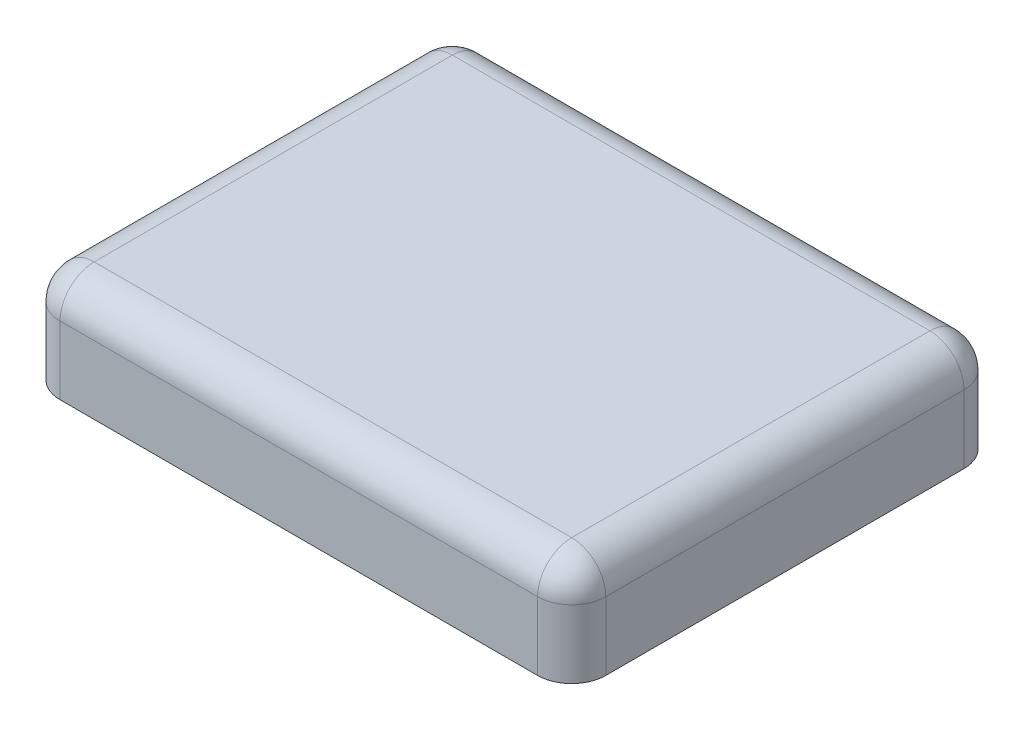
ISO-10303-21;
HEADER;
FILE_DESCRIPTION(('STEP AP214'),'2;1');
FILE_NAME('part.step','',(''),(''),'','','');
FILE_SCHEMA(('AUTOMOTIVE_DESIGN { 1 0 10303 214 1 1 1 1 }'));
ENDSEC;
DATA;
#1=APPLICATION_CONTEXT('core data for automotive mechanical design processes');
#2=APPLICATION_PROTOCOL_DEFINITION('international standard','automotive_design',2000,#1);
#3=PRODUCT_CONTEXT('',#1,'mechanical');
#4=PRODUCT('Part','Part','',(#3));
#5=PRODUCT_RELATED_PRODUCT_CATEGORY('part','',(#4));
#6=PRODUCT_DEFINITION_FORMATION('','',#4);
#7=PRODUCT_DEFINITION_CONTEXT('part definition',#1,'design');
#8=PRODUCT_DEFINITION('design','',#6,#7);
#9=PRODUCT_DEFINITION_SHAPE('','',#8);
#10=(LENGTH_UNIT() NAMED_UNIT(*) SI_UNIT(.MILLI.,.METRE.));
#11=(NAMED_UNIT(*) PLANE_ANGLE_UNIT() SI_UNIT($,.RADIAN.));
#12=(NAMED_UNIT(*) SI_UNIT($,.STERADIAN.) SOLID_ANGLE_UNIT());
#13=UNCERTAINTY_MEASURE_WITH_UNIT(LENGTH_MEASURE(1.E-05),#10,'distance_accuracy_value','');
#14=(GEOMETRIC_REPRESENTATION_CONTEXT(3) GLOBAL_UNCERTAINTY_ASSIGNED_CONTEXT((#13)) GLOBAL_UNIT_ASSIGNED_CONTEXT((#10,
#11,#12)) REPRESENTATION_CONTEXT('',''));
#15=CARTESIAN_POINT('',(0.,0.,0.));
#16=DIRECTION('',(0.,0.,1.));
#17=DIRECTION('',(1.,0.,0.));
#18=AXIS2_PLACEMENT_3D('',#15,#16,#17);
#19=CARTESIAN_POINT('',(1.6,0.6,-1.25));
#20=DIRECTION('',(-1.,0.,0.));
#21=DIRECTION('',(0.,0.,1.));
#22=AXIS2_PLACEMENT_3D('',#19,#20,#21);
#23=PLANE('',#22);
#24=DIRECTION('',(0.,-1.,0.));
#25=VECTOR('',#24,1.);
#26=CARTESIAN_POINT('',(1.6,0.6,-1.05));
#27=LINE('',#26,#25);
#28=CARTESIAN_POINT('',(1.6,0.,-1.05));
#29=VERTEX_POINT('',#28);
#30=CARTESIAN_POINT('',(1.6,0.4,-1.05));
#31=VERTEX_POINT('',#30);
#32=EDGE_CURVE('E129',#29,#31,#27,.F.);
#33=ORIENTED_EDGE('',*,*,#32,.T.);
#34=DIRECTION('',(0.,0.,-1.));
#35=VECTOR('',#34,1.);
#36=CARTESIAN_POINT('',(1.6,0.4,1.05));
#37=LINE('',#36,#35);
#38=CARTESIAN_POINT('',(1.6,0.4,1.05));
#39=VERTEX_POINT('',#38);
#40=EDGE_CURVE('E69',#31,#39,#37,.F.);
#41=ORIENTED_EDGE('',*,*,#40,.T.);
#42=DIRECTION('',(0.,-1.,0.));
#43=VECTOR('',#42,1.);
#44=CARTESIAN_POINT('',(1.6,0.6,1.05));
#45=LINE('',#44,#43);
#46=CARTESIAN_POINT('',(1.6,0.,1.05));
#47=VERTEX_POINT('',#46);
#48=EDGE_CURVE('E122',#39,#47,#45,.T.);
#49=ORIENTED_EDGE('',*,*,#48,.T.);
#50=DIRECTION('',(0.,0.,-1.));
#51=VECTOR('',#50,1.);
#52=CARTESIAN_POINT('',(1.6,0.,-1.25));
#53=LINE('',#52,#51);
#54=EDGE_CURVE('E125',#47,#29,#53,.T.);
#55=ORIENTED_EDGE('',*,*,#54,.T.);
#56=EDGE_LOOP('',(#33,#41,#49,#55));
#57=FACE_BOUND('',#56,.T.);
#58=ADVANCED_FACE('F45',(#57),#23,.F.);
#59=CARTESIAN_POINT('',(-1.6,0.6,-1.25));
#60=DIRECTION('',(0.,0.,1.));
#61=DIRECTION('',(1.,0.,0.));
#62=AXIS2_PLACEMENT_3D('',#59,#60,#61);
#63=PLANE('',#62);
#64=DIRECTION('',(0.,-1.,0.));
#65=VECTOR('',#64,1.);
#66=CARTESIAN_POINT('',(-1.4,0.6,-1.25));
#67=LINE('',#66,#65);
#68=CARTESIAN_POINT('',(-1.4,0.,-1.25));
#69=VERTEX_POINT('',#68);
#70=CARTESIAN_POINT('',(-1.4,0.4,-1.25));
#71=VERTEX_POINT('',#70);
#72=EDGE_CURVE('E162',#69,#71,#67,.F.);
#73=ORIENTED_EDGE('',*,*,#72,.T.);
#74=DIRECTION('',(-1.,0.,0.));
#75=VECTOR('',#74,1.);
#76=CARTESIAN_POINT('',(1.4,0.4,-1.25));
#77=LINE('',#76,#75);
#78=CARTESIAN_POINT('',(1.4,0.4,-1.25));
#79=VERTEX_POINT('',#78);
#80=EDGE_CURVE('E188',#71,#79,#77,.F.);
#81=ORIENTED_EDGE('',*,*,#80,.T.);
#82=DIRECTION('',(0.,-1.,0.));
#83=VECTOR('',#82,1.);
#84=CARTESIAN_POINT('',(1.4,0.6,-1.25));
#85=LINE('',#84,#83);
#86=CARTESIAN_POINT('',(1.4,0.,-1.25));
#87=VERTEX_POINT('',#86);
#88=EDGE_CURVE('E165',#79,#87,#85,.T.);
#89=ORIENTED_EDGE('',*,*,#88,.T.);
#90=DIRECTION('',(-1.,0.,0.));
#91=VECTOR('',#90,1.);
#92=CARTESIAN_POINT('',(-1.6,0.,-1.25));
#93=LINE('',#92,#91);
#94=EDGE_CURVE('E143',#87,#69,#93,.T.);
#95=ORIENTED_EDGE('',*,*,#94,.T.);
#96=EDGE_LOOP('',(#73,#81,#89,#95));
#97=FACE_BOUND('',#96,.T.);
#98=ADVANCED_FACE('F247',(#97),#63,.F.);
#99=CARTESIAN_POINT('',(-1.6,0.6,-1.25));
#100=DIRECTION('',(1.,0.,0.));
#101=DIRECTION('',(0.,0.,-1.));
#102=AXIS2_PLACEMENT_3D('',#99,#100,#101);
#103=PLANE('',#102);
#104=DIRECTION('',(0.,-1.,0.));
#105=VECTOR('',#104,1.);
#106=CARTESIAN_POINT('',(-1.6,0.6,1.05));
#107=LINE('',#106,#105);
#108=CARTESIAN_POINT('',(-1.6,0.,1.05));
#109=VERTEX_POINT('',#108);
#110=CARTESIAN_POINT('',(-1.6,0.4,1.05));
#111=VERTEX_POINT('',#110);
#112=EDGE_CURVE('E169',#109,#111,#107,.F.);
#113=ORIENTED_EDGE('',*,*,#112,.T.);
#114=DIRECTION('',(0.,0.,1.));
#115=VECTOR('',#114,1.);
#116=CARTESIAN_POINT('',(-1.6,0.4,-1.05));
#117=LINE('',#116,#115);
#118=CARTESIAN_POINT('',(-1.6,0.4,-1.05));
#119=VERTEX_POINT('',#118);
#120=EDGE_CURVE('E184',#111,#119,#117,.F.);
#121=ORIENTED_EDGE('',*,*,#120,.T.);
#122=DIRECTION('',(0.,-1.,0.));
#123=VECTOR('',#122,1.);
#124=CARTESIAN_POINT('',(-1.6,0.6,-1.05));
#125=LINE('',#124,#123);
#126=CARTESIAN_POINT('',(-1.6,0.,-1.05));
#127=VERTEX_POINT('',#126);
#128=EDGE_CURVE('E167',#119,#127,#125,.T.);
#129=ORIENTED_EDGE('',*,*,#128,.T.);
#130=DIRECTION('',(0.,0.,1.));
#131=VECTOR('',#130,1.);
#132=CARTESIAN_POINT('',(-1.6,0.,-1.25));
#133=LINE('',#132,#131);
#134=EDGE_CURVE('E146',#127,#109,#133,.T.);
#135=ORIENTED_EDGE('',*,*,#134,.T.);
#136=EDGE_LOOP('',(#113,#121,#129,#135));
#137=FACE_BOUND('',#136,.T.);
#138=ADVANCED_FACE('F253',(#137),#103,.F.);
#139=CARTESIAN_POINT('',(-1.6,0.6,1.25));
#140=DIRECTION('',(0.,0.,-1.));
#141=DIRECTION('',(-1.,0.,0.));
#142=AXIS2_PLACEMENT_3D('',#139,#140,#141);
#143=PLANE('',#142);
#144=DIRECTION('',(0.,-1.,0.));
#145=VECTOR('',#144,1.);
#146=CARTESIAN_POINT('',(1.4,0.6,1.25));
#147=LINE('',#146,#145);
#148=CARTESIAN_POINT('',(1.4,0.,1.25));
#149=VERTEX_POINT('',#148);
#150=CARTESIAN_POINT('',(1.4,0.4,1.25));
#151=VERTEX_POINT('',#150);
#152=EDGE_CURVE('E133',#149,#151,#147,.F.);
#153=ORIENTED_EDGE('',*,*,#152,.T.);
#154=DIRECTION('',(1.,0.,0.));
#155=VECTOR('',#154,1.);
#156=CARTESIAN_POINT('',(-1.4,0.4,1.25));
#157=LINE('',#156,#155);
#158=CARTESIAN_POINT('',(-1.4,0.4,1.25));
#159=VERTEX_POINT('',#158);
#160=EDGE_CURVE('E11',#151,#159,#157,.F.);
#161=ORIENTED_EDGE('',*,*,#160,.T.);
#162=DIRECTION('',(0.,-1.,0.));
#163=VECTOR('',#162,1.);
#164=CARTESIAN_POINT('',(-1.4,0.6,1.25));
#165=LINE('',#164,#163);
#166=CARTESIAN_POINT('',(-1.4,0.,1.25));
#167=VERTEX_POINT('',#166);
#168=EDGE_CURVE('E137',#159,#167,#165,.T.);
#169=ORIENTED_EDGE('',*,*,#168,.T.);
#170=DIRECTION('',(1.,0.,0.));
#171=VECTOR('',#170,1.);
#172=CARTESIAN_POINT('',(-1.6,0.,1.25));
#173=LINE('',#172,#171);
#174=EDGE_CURVE('E153',#167,#149,#173,.T.);
#175=ORIENTED_EDGE('',*,*,#174,.T.);
#176=EDGE_LOOP('',(#153,#161,#169,#175));
#177=FACE_BOUND('',#176,.T.);
#178=ADVANCED_FACE('F346',(#177),#143,.F.);
#179=CARTESIAN_POINT('',(0.,0.6,0.));
#180=DIRECTION('',(0.,1.,0.));
#181=DIRECTION('',(0.,0.,1.));
#182=AXIS2_PLACEMENT_3D('',#179,#180,#181);
#183=PLANE('',#182);
#184=DIRECTION('',(-1.,0.,0.));
#185=VECTOR('',#184,1.);
#186=CARTESIAN_POINT('',(-1.4,0.6,-1.05));
#187=LINE('',#186,#185);
#188=CARTESIAN_POINT('',(1.4,0.6,-1.05));
#189=VERTEX_POINT('',#188);
#190=CARTESIAN_POINT('',(-1.4,0.6,-1.05));
#191=VERTEX_POINT('',#190);
#192=EDGE_CURVE('E179',#189,#191,#187,.T.);
#193=ORIENTED_EDGE('',*,*,#192,.T.);
#194=DIRECTION('',(0.,0.,1.));
#195=VECTOR('',#194,1.);
#196=CARTESIAN_POINT('',(-1.4,0.6,1.05));
#197=LINE('',#196,#195);
#198=CARTESIAN_POINT('',(-1.4,0.6,1.05));
#199=VERTEX_POINT('',#198);
#200=EDGE_CURVE('E181',#191,#199,#197,.T.);
#201=ORIENTED_EDGE('',*,*,#200,.T.);
#202=DIRECTION('',(1.,0.,0.));
#203=VECTOR('',#202,1.);
#204=CARTESIAN_POINT('',(1.4,0.6,1.05));
#205=LINE('',#204,#203);
#206=CARTESIAN_POINT('',(1.4,0.6,1.05));
#207=VERTEX_POINT('',#206);
#208=EDGE_CURVE('E175',#199,#207,#205,.T.);
#209=ORIENTED_EDGE('',*,*,#208,.T.);
#210=DIRECTION('',(0.,0.,-1.));
#211=VECTOR('',#210,1.);
#212=CARTESIAN_POINT('',(1.4,0.6,-1.05));
#213=LINE('',#212,#211);
#214=EDGE_CURVE('E177',#207,#189,#213,.T.);
#215=ORIENTED_EDGE('',*,*,#214,.T.);
#216=EDGE_LOOP('',(#193,#201,#209,#215));
#217=FACE_BOUND('',#216,.T.);
#218=ADVANCED_FACE('F224',(#217),#183,.T.);
#219=CARTESIAN_POINT('',(0.,0.,0.));
#220=DIRECTION('',(0.,1.,0.));
#221=DIRECTION('',(0.,0.,1.));
#222=AXIS2_PLACEMENT_3D('',#219,#220,#221);
#223=PLANE('',#222);
#224=ORIENTED_EDGE('',*,*,#54,.F.);
#225=CARTESIAN_POINT('',(1.4,0.,1.05));
#226=DIRECTION('',(0.,1.,0.));
#227=DIRECTION('',(0.,0.,1.));
#228=AXIS2_PLACEMENT_3D('',#225,#226,#227);
#229=CIRCLE('',#228,0.2);
#230=EDGE_CURVE('E131',#47,#149,#229,.F.);
#231=ORIENTED_EDGE('',*,*,#230,.T.);
#232=ORIENTED_EDGE('',*,*,#174,.F.);
#233=CARTESIAN_POINT('',(-1.4,0.,1.05));
#234=DIRECTION('',(0.,1.,0.));
#235=DIRECTION('',(0.,0.,1.));
#236=AXIS2_PLACEMENT_3D('',#233,#234,#235);
#237=CIRCLE('',#236,0.2);
#238=EDGE_CURVE('E157',#167,#109,#237,.F.);
#239=ORIENTED_EDGE('',*,*,#238,.T.);
#240=ORIENTED_EDGE('',*,*,#134,.F.);
#241=CARTESIAN_POINT('',(-1.4,0.,-1.05));
#242=DIRECTION('',(0.,1.,0.));
#243=DIRECTION('',(0.,0.,1.));
#244=AXIS2_PLACEMENT_3D('',#241,#242,#243);
#245=CIRCLE('',#244,0.2);
#246=EDGE_CURVE('E128',#127,#69,#245,.F.);
#247=ORIENTED_EDGE('',*,*,#246,.T.);
#248=ORIENTED_EDGE('',*,*,#94,.F.);
#249=CARTESIAN_POINT('',(1.4,0.,-1.05));
#250=DIRECTION('',(0.,1.,0.));
#251=DIRECTION('',(0.,0.,1.));
#252=AXIS2_PLACEMENT_3D('',#249,#250,#251);
#253=CIRCLE('',#252,0.2);
#254=EDGE_CURVE('E138',#87,#29,#253,.F.);
#255=ORIENTED_EDGE('',*,*,#254,.T.);
#256=EDGE_LOOP('',(#224,#231,#232,#239,#240,#247,#248,#255));
#257=FACE_BOUND('',#256,.T.);
#258=ADVANCED_FACE('F140',(#257),#223,.F.);
#259=CARTESIAN_POINT('',(1.4,0.6,1.05));
#260=DIRECTION('',(0.,-1.,0.));
#261=DIRECTION('',(0.,0.,-1.));
#262=AXIS2_PLACEMENT_3D('',#259,#260,#261);
#263=CYLINDRICAL_SURFACE('',#262,0.2);
#264=ORIENTED_EDGE('',*,*,#48,.F.);
#265=CARTESIAN_POINT('',(1.4,0.4,1.05));
#266=DIRECTION('',(0.,-1.,0.));
#267=DIRECTION('',(0.,0.,-1.));
#268=AXIS2_PLACEMENT_3D('',#265,#266,#267);
#269=CIRCLE('',#268,0.2);
#270=EDGE_CURVE('E54',#39,#151,#269,.T.);
#271=ORIENTED_EDGE('',*,*,#270,.T.);
#272=ORIENTED_EDGE('',*,*,#152,.F.);
#273=ORIENTED_EDGE('',*,*,#230,.F.);
#274=EDGE_LOOP('',(#264,#271,#272,#273));
#275=FACE_BOUND('',#274,.T.);
#276=ADVANCED_FACE('F132',(#275),#263,.T.);
#277=CARTESIAN_POINT('',(1.4,0.6,-1.05));
#278=DIRECTION('',(0.,-1.,0.));
#279=DIRECTION('',(0.,0.,-1.));
#280=AXIS2_PLACEMENT_3D('',#277,#278,#279);
#281=CYLINDRICAL_SURFACE('',#280,0.2);
#282=ORIENTED_EDGE('',*,*,#88,.F.);
#283=CARTESIAN_POINT('',(1.4,0.4,-1.05));
#284=DIRECTION('',(0.,-1.,0.));
#285=DIRECTION('',(0.,0.,-1.));
#286=AXIS2_PLACEMENT_3D('',#283,#284,#285);
#287=CIRCLE('',#286,0.2);
#288=EDGE_CURVE('E190',#79,#31,#287,.T.);
#289=ORIENTED_EDGE('',*,*,#288,.T.);
#290=ORIENTED_EDGE('',*,*,#32,.F.);
#291=ORIENTED_EDGE('',*,*,#254,.F.);
#292=EDGE_LOOP('',(#282,#289,#290,#291));
#293=FACE_BOUND('',#292,.T.);
#294=ADVANCED_FACE('F260',(#293),#281,.T.);
#295=CARTESIAN_POINT('',(-1.4,0.6,1.05));
#296=DIRECTION('',(0.,-1.,0.));
#297=DIRECTION('',(0.,0.,-1.));
#298=AXIS2_PLACEMENT_3D('',#295,#296,#297);
#299=CYLINDRICAL_SURFACE('',#298,0.2);
#300=ORIENTED_EDGE('',*,*,#168,.F.);
#301=CARTESIAN_POINT('',(-1.4,0.4,1.05));
#302=DIRECTION('',(0.,-1.,0.));
#303=DIRECTION('',(0.,0.,-1.));
#304=AXIS2_PLACEMENT_3D('',#301,#302,#303);
#305=CIRCLE('',#304,0.2);
#306=EDGE_CURVE('E172',#159,#111,#305,.T.);
#307=ORIENTED_EDGE('',*,*,#306,.T.);
#308=ORIENTED_EDGE('',*,*,#112,.F.);
#309=ORIENTED_EDGE('',*,*,#238,.F.);
#310=EDGE_LOOP('',(#300,#307,#308,#309));
#311=FACE_BOUND('',#310,.T.);
#312=ADVANCED_FACE('F263',(#311),#299,.T.);
#313=CARTESIAN_POINT('',(-1.4,0.6,-1.05));
#314=DIRECTION('',(0.,-1.,0.));
#315=DIRECTION('',(0.,0.,-1.));
#316=AXIS2_PLACEMENT_3D('',#313,#314,#315);
#317=CYLINDRICAL_SURFACE('',#316,0.2);
#318=ORIENTED_EDGE('',*,*,#128,.F.);
#319=CARTESIAN_POINT('',(-1.4,0.4,-1.05));
#320=DIRECTION('',(0.,-1.,0.));
#321=DIRECTION('',(0.,0.,-1.));
#322=AXIS2_PLACEMENT_3D('',#319,#320,#321);
#323=CIRCLE('',#322,0.2);
#324=EDGE_CURVE('E186',#119,#71,#323,.T.);
#325=ORIENTED_EDGE('',*,*,#324,.T.);
#326=ORIENTED_EDGE('',*,*,#72,.F.);
#327=ORIENTED_EDGE('',*,*,#246,.F.);
#328=EDGE_LOOP('',(#318,#325,#326,#327));
#329=FACE_BOUND('',#328,.T.);
#330=ADVANCED_FACE('F267',(#329),#317,.T.);
#331=CARTESIAN_POINT('',(1.4,0.4,-1.05));
#332=DIRECTION('',(0.,1.,0.));
#333=DIRECTION('',(0.,0.,1.));
#334=AXIS2_PLACEMENT_3D('',#331,#332,#333);
#335=SPHERICAL_SURFACE('',#334,0.2);
#336=CARTESIAN_POINT('',(1.4,0.4,-1.05));
#337=DIRECTION('',(0.,0.,1.));
#338=DIRECTION('',(1.,0.,0.));
#339=AXIS2_PLACEMENT_3D('',#336,#337,#338);
#340=CIRCLE('',#339,0.2);
#341=EDGE_CURVE('E149',#31,#189,#340,.T.);
#342=ORIENTED_EDGE('',*,*,#341,.F.);
#343=ORIENTED_EDGE('',*,*,#288,.F.);
#344=CARTESIAN_POINT('',(1.4,0.4,-1.05));
#345=DIRECTION('',(-1.,0.,0.));
#346=DIRECTION('',(0.,0.,1.));
#347=AXIS2_PLACEMENT_3D('',#344,#345,#346);
#348=CIRCLE('',#347,0.2);
#349=EDGE_CURVE('E49',#189,#79,#348,.T.);
#350=ORIENTED_EDGE('',*,*,#349,.F.);
#351=EDGE_LOOP('',(#342,#343,#350));
#352=FACE_BOUND('',#351,.T.);
#353=ADVANCED_FACE('F47',(#352),#335,.T.);
#354=CARTESIAN_POINT('',(0.,0.4,-1.05));
#355=DIRECTION('',(1.,0.,0.));
#356=DIRECTION('',(0.,0.,-1.));
#357=AXIS2_PLACEMENT_3D('',#354,#355,#356);
#358=CYLINDRICAL_SURFACE('',#357,0.2);
#359=ORIENTED_EDGE('',*,*,#349,.T.);
#360=ORIENTED_EDGE('',*,*,#80,.F.);
#361=CARTESIAN_POINT('',(-1.4,0.4,-1.05));
#362=DIRECTION('',(-1.,0.,0.));
#363=DIRECTION('',(0.,0.,1.));
#364=AXIS2_PLACEMENT_3D('',#361,#362,#363);
#365=CIRCLE('',#364,0.2);
#366=EDGE_CURVE('E207',#191,#71,#365,.T.);
#367=ORIENTED_EDGE('',*,*,#366,.F.);
#368=ORIENTED_EDGE('',*,*,#192,.F.);
#369=EDGE_LOOP('',(#359,#360,#367,#368));
#370=FACE_BOUND('',#369,.T.);
#371=ADVANCED_FACE('F221',(#370),#358,.T.);
#372=CARTESIAN_POINT('',(1.4,0.4,0.));
#373=DIRECTION('',(0.,0.,1.));
#374=DIRECTION('',(1.,0.,0.));
#375=AXIS2_PLACEMENT_3D('',#372,#373,#374);
#376=CYLINDRICAL_SURFACE('',#375,0.2);
#377=ORIENTED_EDGE('',*,*,#341,.T.);
#378=ORIENTED_EDGE('',*,*,#214,.F.);
#379=CARTESIAN_POINT('',(1.4,0.4,1.05));
#380=DIRECTION('',(0.,0.,1.));
#381=DIRECTION('',(1.,0.,0.));
#382=AXIS2_PLACEMENT_3D('',#379,#380,#381);
#383=CIRCLE('',#382,0.2);
#384=EDGE_CURVE('E204',#39,#207,#383,.T.);
#385=ORIENTED_EDGE('',*,*,#384,.F.);
#386=ORIENTED_EDGE('',*,*,#40,.F.);
#387=EDGE_LOOP('',(#377,#378,#385,#386));
#388=FACE_BOUND('',#387,.T.);
#389=ADVANCED_FACE('F214',(#388),#376,.T.);
#390=CARTESIAN_POINT('',(-1.4,0.4,-1.05));
#391=DIRECTION('',(0.,1.,0.));
#392=DIRECTION('',(0.,0.,1.));
#393=AXIS2_PLACEMENT_3D('',#390,#391,#392);
#394=SPHERICAL_SURFACE('',#393,0.2);
#395=ORIENTED_EDGE('',*,*,#366,.T.);
#396=ORIENTED_EDGE('',*,*,#324,.F.);
#397=CARTESIAN_POINT('',(-1.4,0.4,-1.05));
#398=DIRECTION('',(0.,0.,1.));
#399=DIRECTION('',(1.,0.,0.));
#400=AXIS2_PLACEMENT_3D('',#397,#398,#399);
#401=CIRCLE('',#400,0.2);
#402=EDGE_CURVE('E201',#191,#119,#401,.T.);
#403=ORIENTED_EDGE('',*,*,#402,.F.);
#404=EDGE_LOOP('',(#395,#396,#403));
#405=FACE_BOUND('',#404,.T.);
#406=ADVANCED_FACE('F236',(#405),#394,.T.);
#407=CARTESIAN_POINT('',(1.4,0.4,1.05));
#408=DIRECTION('',(0.,1.,0.));
#409=DIRECTION('',(0.,0.,1.));
#410=AXIS2_PLACEMENT_3D('',#407,#408,#409);
#411=SPHERICAL_SURFACE('',#410,0.2);
#412=ORIENTED_EDGE('',*,*,#270,.F.);
#413=ORIENTED_EDGE('',*,*,#384,.T.);
#414=CARTESIAN_POINT('',(1.4,0.4,1.05));
#415=DIRECTION('',(-1.,0.,0.));
#416=DIRECTION('',(0.,0.,1.));
#417=AXIS2_PLACEMENT_3D('',#414,#415,#416);
#418=CIRCLE('',#417,0.2);
#419=EDGE_CURVE('E198',#151,#207,#418,.T.);
#420=ORIENTED_EDGE('',*,*,#419,.F.);
#421=EDGE_LOOP('',(#412,#413,#420));
#422=FACE_BOUND('',#421,.T.);
#423=ADVANCED_FACE('F233',(#422),#411,.T.);
#424=CARTESIAN_POINT('',(-1.4,0.4,0.));
#425=DIRECTION('',(0.,0.,-1.));
#426=DIRECTION('',(-1.,0.,0.));
#427=AXIS2_PLACEMENT_3D('',#424,#425,#426);
#428=CYLINDRICAL_SURFACE('',#427,0.2);
#429=ORIENTED_EDGE('',*,*,#402,.T.);
#430=ORIENTED_EDGE('',*,*,#120,.F.);
#431=CARTESIAN_POINT('',(-1.4,0.4,1.05));
#432=DIRECTION('',(0.,0.,1.));
#433=DIRECTION('',(1.,0.,0.));
#434=AXIS2_PLACEMENT_3D('',#431,#432,#433);
#435=CIRCLE('',#434,0.2);
#436=EDGE_CURVE('E196',#199,#111,#435,.T.);
#437=ORIENTED_EDGE('',*,*,#436,.F.);
#438=ORIENTED_EDGE('',*,*,#200,.F.);
#439=EDGE_LOOP('',(#429,#430,#437,#438));
#440=FACE_BOUND('',#439,.T.);
#441=ADVANCED_FACE('F235',(#440),#428,.T.);
#442=CARTESIAN_POINT('',(0.,0.4,1.05));
#443=DIRECTION('',(-1.,0.,0.));
#444=DIRECTION('',(0.,0.,1.));
#445=AXIS2_PLACEMENT_3D('',#442,#443,#444);
#446=CYLINDRICAL_SURFACE('',#445,0.2);
#447=ORIENTED_EDGE('',*,*,#419,.T.);
#448=ORIENTED_EDGE('',*,*,#208,.F.);
#449=CARTESIAN_POINT('',(-1.4,0.4,1.05));
#450=DIRECTION('',(-1.,0.,0.));
#451=DIRECTION('',(0.,0.,1.));
#452=AXIS2_PLACEMENT_3D('',#449,#450,#451);
#453=CIRCLE('',#452,0.2);
#454=EDGE_CURVE('E194',#159,#199,#453,.T.);
#455=ORIENTED_EDGE('',*,*,#454,.F.);
#456=ORIENTED_EDGE('',*,*,#160,.F.);
#457=EDGE_LOOP('',(#447,#448,#455,#456));
#458=FACE_BOUND('',#457,.T.);
#459=ADVANCED_FACE('F229',(#458),#446,.T.);
#460=CARTESIAN_POINT('',(-1.4,0.4,1.05));
#461=DIRECTION('',(0.,1.,0.));
#462=DIRECTION('',(0.,0.,1.));
#463=AXIS2_PLACEMENT_3D('',#460,#461,#462);
#464=SPHERICAL_SURFACE('',#463,0.2);
#465=ORIENTED_EDGE('',*,*,#436,.T.);
#466=ORIENTED_EDGE('',*,*,#306,.F.);
#467=ORIENTED_EDGE('',*,*,#454,.T.);
#468=EDGE_LOOP('',(#465,#466,#467));
#469=FACE_BOUND('',#468,.T.);
#470=ADVANCED_FACE('F272',(#469),#464,.T.);
#471=CLOSED_SHELL('',(#58,#98,#138,#178,#218,#258,#276,#294,#312,#330,#353,#371,#389,#406,#423,
#441,#459,#470));
#472=MANIFOLD_SOLID_BREP('B2',#471);
#473=ADVANCED_BREP_SHAPE_REPRESENTATION('',(#18,#472),#14);
#474=SHAPE_DEFINITION_REPRESENTATION(#9,#473);
ENDSEC;
END-ISO-10303-21;
